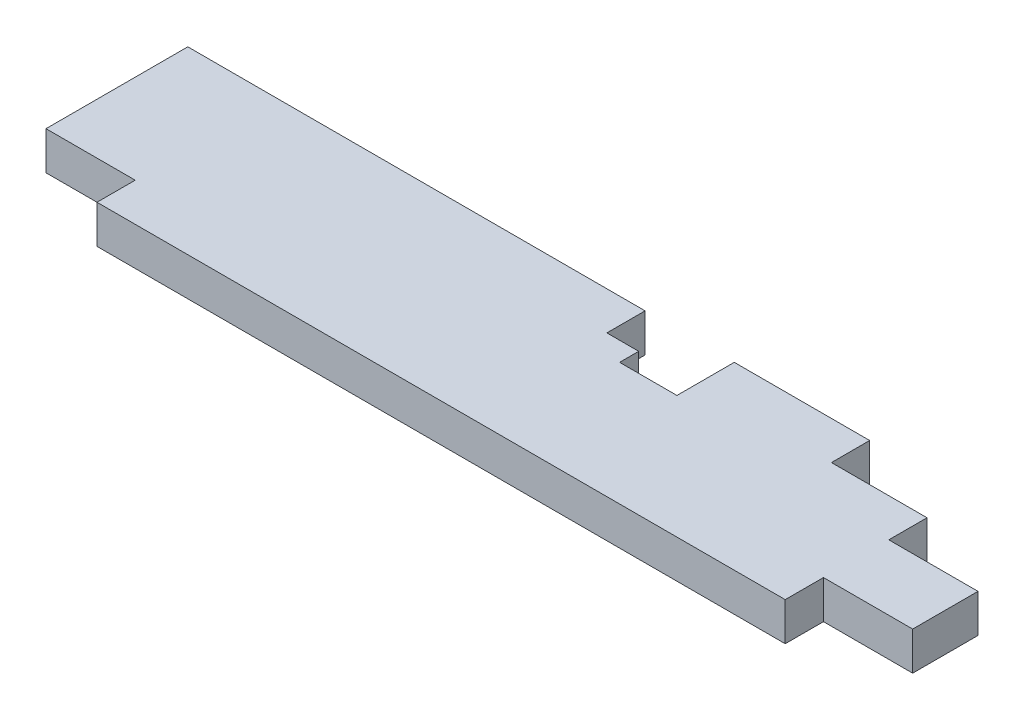
ISO-10303-21;
HEADER;
FILE_DESCRIPTION(('STEP AP214'),'2;1');
FILE_NAME('part.step','',(''),(''),'','','');
FILE_SCHEMA(('AUTOMOTIVE_DESIGN { 1 0 10303 214 1 1 1 1 }'));
ENDSEC;
DATA;
#1=APPLICATION_CONTEXT('core data for automotive mechanical design processes');
#2=APPLICATION_PROTOCOL_DEFINITION('international standard','automotive_design',2000,#1);
#3=PRODUCT_CONTEXT('',#1,'mechanical');
#4=PRODUCT('Part','Part','',(#3));
#5=PRODUCT_RELATED_PRODUCT_CATEGORY('part','',(#4));
#6=PRODUCT_DEFINITION_FORMATION('','',#4);
#7=PRODUCT_DEFINITION_CONTEXT('part definition',#1,'design');
#8=PRODUCT_DEFINITION('design','',#6,#7);
#9=PRODUCT_DEFINITION_SHAPE('','',#8);
#10=(LENGTH_UNIT() NAMED_UNIT(*) SI_UNIT(.MILLI.,.METRE.));
#11=(NAMED_UNIT(*) PLANE_ANGLE_UNIT() SI_UNIT($,.RADIAN.));
#12=(NAMED_UNIT(*) SI_UNIT($,.STERADIAN.) SOLID_ANGLE_UNIT());
#13=UNCERTAINTY_MEASURE_WITH_UNIT(LENGTH_MEASURE(1.E-05),#10,'distance_accuracy_value','');
#14=(GEOMETRIC_REPRESENTATION_CONTEXT(3) GLOBAL_UNCERTAINTY_ASSIGNED_CONTEXT((#13)) GLOBAL_UNIT_ASSIGNED_CONTEXT((#10,
#11,#12)) REPRESENTATION_CONTEXT('',''));
#15=CARTESIAN_POINT('',(0.,0.,0.));
#16=DIRECTION('',(0.,0.,1.));
#17=DIRECTION('',(1.,0.,0.));
#18=AXIS2_PLACEMENT_3D('',#15,#16,#17);
#19=CARTESIAN_POINT('',(0.,38.1,-179.3875));
#20=DIRECTION('',(0.,0.,1.));
#21=DIRECTION('',(1.,0.,0.));
#22=AXIS2_PLACEMENT_3D('',#19,#20,#21);
#23=PLANE('',#22);
#24=DIRECTION('',(0.,-1.,0.));
#25=VECTOR('',#24,1.);
#26=CARTESIAN_POINT('',(544.564540790002,38.1,-179.3875));
#27=LINE('',#26,#25);
#28=CARTESIAN_POINT('',(544.564540790002,38.1,-179.3875));
#29=VERTEX_POINT('',#28);
#30=CARTESIAN_POINT('',(544.564540790002,0.,-179.3875));
#31=VERTEX_POINT('',#30);
#32=EDGE_CURVE('E240',#29,#31,#27,.T.);
#33=ORIENTED_EDGE('',*,*,#32,.F.);
#34=DIRECTION('',(-1.,0.,0.));
#35=VECTOR('',#34,1.);
#36=CARTESIAN_POINT('',(0.,38.1,-179.3875));
#37=LINE('',#36,#35);
#38=CARTESIAN_POINT('',(679.45,38.1,-179.3875));
#39=VERTEX_POINT('',#38);
#40=EDGE_CURVE('E49',#39,#29,#37,.T.);
#41=ORIENTED_EDGE('',*,*,#40,.F.);
#42=DIRECTION('',(0.,-1.,0.));
#43=VECTOR('',#42,1.);
#44=CARTESIAN_POINT('',(679.45,38.1,-179.3875));
#45=LINE('',#44,#43);
#46=CARTESIAN_POINT('',(679.45,0.,-179.3875));
#47=VERTEX_POINT('',#46);
#48=EDGE_CURVE('E260',#39,#47,#45,.T.);
#49=ORIENTED_EDGE('',*,*,#48,.T.);
#50=DIRECTION('',(-1.,0.,0.));
#51=VECTOR('',#50,1.);
#52=CARTESIAN_POINT('',(0.,0.,-179.3875));
#53=LINE('',#52,#51);
#54=EDGE_CURVE('E289',#47,#31,#53,.T.);
#55=ORIENTED_EDGE('',*,*,#54,.T.);
#56=EDGE_LOOP('',(#33,#41,#49,#55));
#57=FACE_BOUND('',#56,.T.);
#58=ADVANCED_FACE('F41',(#57),#23,.F.);
#59=DIRECTION('',(0.,-1.,0.));
#60=VECTOR('',#59,1.);
#61=CARTESIAN_POINT('',(455.676,38.1,-179.3875));
#62=LINE('',#61,#60);
#63=CARTESIAN_POINT('',(455.676,38.1,-179.3875));
#64=VERTEX_POINT('',#63);
#65=CARTESIAN_POINT('',(455.676,0.,-179.3875));
#66=VERTEX_POINT('',#65);
#67=EDGE_CURVE('E242',#64,#66,#62,.T.);
#68=ORIENTED_EDGE('',*,*,#67,.T.);
#69=CARTESIAN_POINT('',(0.,0.,-179.3875));
#70=VERTEX_POINT('',#69);
#71=EDGE_CURVE('E301',#66,#70,#53,.T.);
#72=ORIENTED_EDGE('',*,*,#71,.T.);
#73=DIRECTION('',(0.,-1.,0.));
#74=VECTOR('',#73,1.);
#75=CARTESIAN_POINT('',(0.,38.1,-179.3875));
#76=LINE('',#75,#74);
#77=CARTESIAN_POINT('',(0.,38.1,-179.3875));
#78=VERTEX_POINT('',#77);
#79=EDGE_CURVE('E11',#78,#70,#76,.T.);
#80=ORIENTED_EDGE('',*,*,#79,.F.);
#81=EDGE_CURVE('E294',#64,#78,#37,.T.);
#82=ORIENTED_EDGE('',*,*,#81,.F.);
#83=EDGE_LOOP('',(#68,#72,#80,#82));
#84=FACE_BOUND('',#83,.T.);
#85=ADVANCED_FACE('F309',(#84),#23,.F.);
#86=CARTESIAN_POINT('',(0.,38.1,0.));
#87=DIRECTION('',(0.,-1.,0.));
#88=DIRECTION('',(0.,0.,-1.));
#89=AXIS2_PLACEMENT_3D('',#86,#87,#88);
#90=PLANE('',#89);
#91=DIRECTION('',(0.,0.,1.));
#92=VECTOR('',#91,1.);
#93=CARTESIAN_POINT('',(0.,38.1,0.));
#94=LINE('',#93,#92);
#95=CARTESIAN_POINT('',(0.,38.1,-38.1));
#96=VERTEX_POINT('',#95);
#97=EDGE_CURVE('E285',#78,#96,#94,.T.);
#98=ORIENTED_EDGE('',*,*,#97,.T.);
#99=DIRECTION('',(-1.,0.,0.));
#100=VECTOR('',#99,1.);
#101=CARTESIAN_POINT('',(0.,38.1,-38.1));
#102=LINE('',#101,#100);
#103=CARTESIAN_POINT('',(88.9,38.1,-38.1));
#104=VERTEX_POINT('',#103);
#105=EDGE_CURVE('E186',#104,#96,#102,.T.);
#106=ORIENTED_EDGE('',*,*,#105,.F.);
#107=DIRECTION('',(0.,0.,-1.));
#108=VECTOR('',#107,1.);
#109=CARTESIAN_POINT('',(88.9,38.1,0.));
#110=LINE('',#109,#108);
#111=CARTESIAN_POINT('',(88.9,38.1,0.));
#112=VERTEX_POINT('',#111);
#113=EDGE_CURVE('E168',#112,#104,#110,.T.);
#114=ORIENTED_EDGE('',*,*,#113,.F.);
#115=DIRECTION('',(1.,0.,0.));
#116=VECTOR('',#115,1.);
#117=CARTESIAN_POINT('',(0.,38.1,0.));
#118=LINE('',#117,#116);
#119=CARTESIAN_POINT('',(774.7,38.1,0.));
#120=VERTEX_POINT('',#119);
#121=EDGE_CURVE('E288',#112,#120,#118,.T.);
#122=ORIENTED_EDGE('',*,*,#121,.T.);
#123=DIRECTION('',(0.,0.,-1.));
#124=VECTOR('',#123,1.);
#125=CARTESIAN_POINT('',(774.7,38.1,0.));
#126=LINE('',#125,#124);
#127=CARTESIAN_POINT('',(774.7,38.1,-38.1));
#128=VERTEX_POINT('',#127);
#129=EDGE_CURVE('E266',#120,#128,#126,.T.);
#130=ORIENTED_EDGE('',*,*,#129,.T.);
#131=DIRECTION('',(1.,0.,0.));
#132=VECTOR('',#131,1.);
#133=CARTESIAN_POINT('',(863.6,38.1,-38.1));
#134=LINE('',#133,#132);
#135=CARTESIAN_POINT('',(863.6,38.1,-38.1));
#136=VERTEX_POINT('',#135);
#137=EDGE_CURVE('E269',#128,#136,#134,.T.);
#138=ORIENTED_EDGE('',*,*,#137,.T.);
#139=DIRECTION('',(0.,0.,-1.));
#140=VECTOR('',#139,1.);
#141=CARTESIAN_POINT('',(863.6,38.1,0.));
#142=LINE('',#141,#140);
#143=CARTESIAN_POINT('',(863.6,38.1,-103.1875));
#144=VERTEX_POINT('',#143);
#145=EDGE_CURVE('E291',#136,#144,#142,.T.);
#146=ORIENTED_EDGE('',*,*,#145,.T.);
#147=DIRECTION('',(-1.,0.,0.));
#148=VECTOR('',#147,1.);
#149=CARTESIAN_POINT('',(863.6,38.1,-103.1875));
#150=LINE('',#149,#148);
#151=CARTESIAN_POINT('',(774.7,38.1,-103.1875));
#152=VERTEX_POINT('',#151);
#153=EDGE_CURVE('E194',#144,#152,#150,.T.);
#154=ORIENTED_EDGE('',*,*,#153,.T.);
#155=DIRECTION('',(0.,0.,-1.));
#156=VECTOR('',#155,1.);
#157=CARTESIAN_POINT('',(774.7,38.1,-141.2875));
#158=LINE('',#157,#156);
#159=CARTESIAN_POINT('',(774.7,38.1,-141.2875));
#160=VERTEX_POINT('',#159);
#161=EDGE_CURVE('E197',#152,#160,#158,.T.);
#162=ORIENTED_EDGE('',*,*,#161,.T.);
#163=DIRECTION('',(-1.,0.,0.));
#164=VECTOR('',#163,1.);
#165=CARTESIAN_POINT('',(863.6,38.1,-141.287500000001));
#166=LINE('',#165,#164);
#167=CARTESIAN_POINT('',(679.45,38.1,-141.2875));
#168=VERTEX_POINT('',#167);
#169=EDGE_CURVE('E251',#160,#168,#166,.T.);
#170=ORIENTED_EDGE('',*,*,#169,.T.);
#171=DIRECTION('',(0.,0.,-1.));
#172=VECTOR('',#171,1.);
#173=CARTESIAN_POINT('',(679.45,38.1,-179.3875));
#174=LINE('',#173,#172);
#175=EDGE_CURVE('E253',#168,#39,#174,.T.);
#176=ORIENTED_EDGE('',*,*,#175,.T.);
#177=ORIENTED_EDGE('',*,*,#40,.T.);
#178=DIRECTION('',(0.,0.,-1.));
#179=VECTOR('',#178,1.);
#180=CARTESIAN_POINT('',(544.564540790002,38.1,0.));
#181=LINE('',#180,#179);
#182=CARTESIAN_POINT('',(544.564540790002,38.1,-122.237499999995));
#183=VERTEX_POINT('',#182);
#184=EDGE_CURVE('E222',#183,#29,#181,.T.);
#185=ORIENTED_EDGE('',*,*,#184,.F.);
#186=DIRECTION('',(-1.,0.,0.));
#187=VECTOR('',#186,1.);
#188=CARTESIAN_POINT('',(0.,38.1,-122.237499999995));
#189=LINE('',#188,#187);
#190=CARTESIAN_POINT('',(487.426,38.1,-122.237499999995));
#191=VERTEX_POINT('',#190);
#192=EDGE_CURVE('E210',#183,#191,#189,.T.);
#193=ORIENTED_EDGE('',*,*,#192,.T.);
#194=DIRECTION('',(0.,0.,-1.));
#195=VECTOR('',#194,1.);
#196=CARTESIAN_POINT('',(487.426,38.1,0.));
#197=LINE('',#196,#195);
#198=CARTESIAN_POINT('',(487.426,38.1,-141.287499999995));
#199=VERTEX_POINT('',#198);
#200=EDGE_CURVE('E213',#191,#199,#197,.T.);
#201=ORIENTED_EDGE('',*,*,#200,.T.);
#202=DIRECTION('',(-1.,0.,0.));
#203=VECTOR('',#202,1.);
#204=CARTESIAN_POINT('',(0.,38.1,-141.287499999995));
#205=LINE('',#204,#203);
#206=CARTESIAN_POINT('',(455.676,38.1,-141.287499999995));
#207=VERTEX_POINT('',#206);
#208=EDGE_CURVE('E217',#199,#207,#205,.T.);
#209=ORIENTED_EDGE('',*,*,#208,.T.);
#210=DIRECTION('',(0.,0.,1.));
#211=VECTOR('',#210,1.);
#212=CARTESIAN_POINT('',(455.676,38.1,0.));
#213=LINE('',#212,#211);
#214=EDGE_CURVE('E220',#64,#207,#213,.T.);
#215=ORIENTED_EDGE('',*,*,#214,.F.);
#216=ORIENTED_EDGE('',*,*,#81,.T.);
#217=EDGE_LOOP('',(#98,#106,#114,#122,#130,#138,#146,#154,#162,#170,#176,#177,#185,#193,#201,
#209,#215,#216));
#218=FACE_BOUND('',#217,.T.);
#219=ADVANCED_FACE('F314',(#218),#90,.F.);
#220=CARTESIAN_POINT('',(0.,0.,0.));
#221=DIRECTION('',(0.,-1.,0.));
#222=DIRECTION('',(0.,0.,-1.));
#223=AXIS2_PLACEMENT_3D('',#220,#221,#222);
#224=PLANE('',#223);
#225=DIRECTION('',(-1.,0.,0.));
#226=VECTOR('',#225,1.);
#227=CARTESIAN_POINT('',(0.,0.,-38.1));
#228=LINE('',#227,#226);
#229=CARTESIAN_POINT('',(88.9,0.,-38.1));
#230=VERTEX_POINT('',#229);
#231=CARTESIAN_POINT('',(0.,0.,-38.1));
#232=VERTEX_POINT('',#231);
#233=EDGE_CURVE('E175',#230,#232,#228,.T.);
#234=ORIENTED_EDGE('',*,*,#233,.T.);
#235=DIRECTION('',(0.,0.,1.));
#236=VECTOR('',#235,1.);
#237=CARTESIAN_POINT('',(0.,0.,0.));
#238=LINE('',#237,#236);
#239=EDGE_CURVE('E280',#70,#232,#238,.T.);
#240=ORIENTED_EDGE('',*,*,#239,.F.);
#241=ORIENTED_EDGE('',*,*,#71,.F.);
#242=DIRECTION('',(0.,0.,1.));
#243=VECTOR('',#242,1.);
#244=CARTESIAN_POINT('',(455.676,0.,0.));
#245=LINE('',#244,#243);
#246=CARTESIAN_POINT('',(455.676,0.,-141.287499999995));
#247=VERTEX_POINT('',#246);
#248=EDGE_CURVE('E232',#66,#247,#245,.T.);
#249=ORIENTED_EDGE('',*,*,#248,.T.);
#250=DIRECTION('',(-1.,0.,0.));
#251=VECTOR('',#250,1.);
#252=CARTESIAN_POINT('',(0.,0.,-141.287499999995));
#253=LINE('',#252,#251);
#254=CARTESIAN_POINT('',(487.426,0.,-141.287499999995));
#255=VERTEX_POINT('',#254);
#256=EDGE_CURVE('E229',#255,#247,#253,.T.);
#257=ORIENTED_EDGE('',*,*,#256,.F.);
#258=DIRECTION('',(0.,0.,-1.));
#259=VECTOR('',#258,1.);
#260=CARTESIAN_POINT('',(487.426,0.,0.));
#261=LINE('',#260,#259);
#262=CARTESIAN_POINT('',(487.426,0.,-122.237499999995));
#263=VERTEX_POINT('',#262);
#264=EDGE_CURVE('E226',#263,#255,#261,.T.);
#265=ORIENTED_EDGE('',*,*,#264,.F.);
#266=DIRECTION('',(-1.,0.,0.));
#267=VECTOR('',#266,1.);
#268=CARTESIAN_POINT('',(0.,0.,-122.237499999995));
#269=LINE('',#268,#267);
#270=CARTESIAN_POINT('',(544.564540790002,0.,-122.237499999995));
#271=VERTEX_POINT('',#270);
#272=EDGE_CURVE('E206',#271,#263,#269,.T.);
#273=ORIENTED_EDGE('',*,*,#272,.F.);
#274=DIRECTION('',(0.,0.,-1.));
#275=VECTOR('',#274,1.);
#276=CARTESIAN_POINT('',(544.564540790002,0.,0.));
#277=LINE('',#276,#275);
#278=EDGE_CURVE('E214',#271,#31,#277,.T.);
#279=ORIENTED_EDGE('',*,*,#278,.T.);
#280=ORIENTED_EDGE('',*,*,#54,.F.);
#281=DIRECTION('',(0.,0.,-1.));
#282=VECTOR('',#281,1.);
#283=CARTESIAN_POINT('',(679.45,0.,-179.3875));
#284=LINE('',#283,#282);
#285=CARTESIAN_POINT('',(679.45,0.,-141.2875));
#286=VERTEX_POINT('',#285);
#287=EDGE_CURVE('E254',#286,#47,#284,.T.);
#288=ORIENTED_EDGE('',*,*,#287,.F.);
#289=DIRECTION('',(-1.,0.,0.));
#290=VECTOR('',#289,1.);
#291=CARTESIAN_POINT('',(863.6,0.,-141.287500000001));
#292=LINE('',#291,#290);
#293=CARTESIAN_POINT('',(774.7,0.,-141.287500000001));
#294=VERTEX_POINT('',#293);
#295=EDGE_CURVE('E239',#294,#286,#292,.T.);
#296=ORIENTED_EDGE('',*,*,#295,.F.);
#297=DIRECTION('',(0.,0.,-1.));
#298=VECTOR('',#297,1.);
#299=CARTESIAN_POINT('',(774.7,0.,-141.2875));
#300=LINE('',#299,#298);
#301=CARTESIAN_POINT('',(774.7,0.,-103.1875));
#302=VERTEX_POINT('',#301);
#303=EDGE_CURVE('E64',#302,#294,#300,.T.);
#304=ORIENTED_EDGE('',*,*,#303,.F.);
#305=DIRECTION('',(-1.,0.,0.));
#306=VECTOR('',#305,1.);
#307=CARTESIAN_POINT('',(863.6,0.,-103.1875));
#308=LINE('',#307,#306);
#309=CARTESIAN_POINT('',(863.6,0.,-103.1875));
#310=VERTEX_POINT('',#309);
#311=EDGE_CURVE('E191',#310,#302,#308,.T.);
#312=ORIENTED_EDGE('',*,*,#311,.F.);
#313=DIRECTION('',(0.,0.,-1.));
#314=VECTOR('',#313,1.);
#315=CARTESIAN_POINT('',(863.6,0.,0.));
#316=LINE('',#315,#314);
#317=CARTESIAN_POINT('',(863.6,0.,-38.1));
#318=VERTEX_POINT('',#317);
#319=EDGE_CURVE('E299',#318,#310,#316,.T.);
#320=ORIENTED_EDGE('',*,*,#319,.F.);
#321=DIRECTION('',(1.,0.,0.));
#322=VECTOR('',#321,1.);
#323=CARTESIAN_POINT('',(863.6,0.,-38.1));
#324=LINE('',#323,#322);
#325=CARTESIAN_POINT('',(774.7,0.,-38.1));
#326=VERTEX_POINT('',#325);
#327=EDGE_CURVE('E270',#326,#318,#324,.T.);
#328=ORIENTED_EDGE('',*,*,#327,.F.);
#329=DIRECTION('',(0.,0.,-1.));
#330=VECTOR('',#329,1.);
#331=CARTESIAN_POINT('',(774.7,0.,0.));
#332=LINE('',#331,#330);
#333=CARTESIAN_POINT('',(774.7,0.,0.));
#334=VERTEX_POINT('',#333);
#335=EDGE_CURVE('E263',#334,#326,#332,.T.);
#336=ORIENTED_EDGE('',*,*,#335,.F.);
#337=DIRECTION('',(1.,0.,0.));
#338=VECTOR('',#337,1.);
#339=CARTESIAN_POINT('',(0.,0.,0.));
#340=LINE('',#339,#338);
#341=CARTESIAN_POINT('',(88.9,0.,0.));
#342=VERTEX_POINT('',#341);
#343=EDGE_CURVE('E185',#342,#334,#340,.T.);
#344=ORIENTED_EDGE('',*,*,#343,.F.);
#345=DIRECTION('',(0.,0.,-1.));
#346=VECTOR('',#345,1.);
#347=CARTESIAN_POINT('',(88.9,0.,0.));
#348=LINE('',#347,#346);
#349=EDGE_CURVE('E56',#342,#230,#348,.T.);
#350=ORIENTED_EDGE('',*,*,#349,.T.);
#351=EDGE_LOOP('',(#234,#240,#241,#249,#257,#265,#273,#279,#280,#288,#296,#304,#312,#320,#328,
#336,#344,#350));
#352=FACE_BOUND('',#351,.T.);
#353=ADVANCED_FACE('F183',(#352),#224,.T.);
#354=CARTESIAN_POINT('',(0.,38.1,0.));
#355=DIRECTION('',(1.,0.,0.));
#356=DIRECTION('',(0.,0.,-1.));
#357=AXIS2_PLACEMENT_3D('',#354,#355,#356);
#358=PLANE('',#357);
#359=ORIENTED_EDGE('',*,*,#239,.T.);
#360=DIRECTION('',(0.,1.,0.));
#361=VECTOR('',#360,1.);
#362=CARTESIAN_POINT('',(0.,0.,-38.1));
#363=LINE('',#362,#361);
#364=EDGE_CURVE('E171',#232,#96,#363,.T.);
#365=ORIENTED_EDGE('',*,*,#364,.T.);
#366=ORIENTED_EDGE('',*,*,#97,.F.);
#367=ORIENTED_EDGE('',*,*,#79,.T.);
#368=EDGE_LOOP('',(#359,#365,#366,#367));
#369=FACE_BOUND('',#368,.T.);
#370=ADVANCED_FACE('F43',(#369),#358,.F.);
#371=CARTESIAN_POINT('',(0.,38.1,0.));
#372=DIRECTION('',(0.,0.,-1.));
#373=DIRECTION('',(-1.,0.,0.));
#374=AXIS2_PLACEMENT_3D('',#371,#372,#373);
#375=PLANE('',#374);
#376=ORIENTED_EDGE('',*,*,#121,.F.);
#377=DIRECTION('',(0.,1.,0.));
#378=VECTOR('',#377,1.);
#379=CARTESIAN_POINT('',(88.9,0.,0.));
#380=LINE('',#379,#378);
#381=EDGE_CURVE('E172',#342,#112,#380,.T.);
#382=ORIENTED_EDGE('',*,*,#381,.F.);
#383=ORIENTED_EDGE('',*,*,#343,.T.);
#384=DIRECTION('',(0.,-1.,0.));
#385=VECTOR('',#384,1.);
#386=CARTESIAN_POINT('',(774.7,38.1,0.));
#387=LINE('',#386,#385);
#388=EDGE_CURVE('E273',#120,#334,#387,.T.);
#389=ORIENTED_EDGE('',*,*,#388,.F.);
#390=EDGE_LOOP('',(#376,#382,#383,#389));
#391=FACE_BOUND('',#390,.T.);
#392=ADVANCED_FACE('F365',(#391),#375,.F.);
#393=CARTESIAN_POINT('',(863.6,38.1,0.));
#394=DIRECTION('',(-1.,0.,0.));
#395=DIRECTION('',(0.,0.,1.));
#396=AXIS2_PLACEMENT_3D('',#393,#394,#395);
#397=PLANE('',#396);
#398=ORIENTED_EDGE('',*,*,#319,.T.);
#399=DIRECTION('',(0.,-1.,0.));
#400=VECTOR('',#399,1.);
#401=CARTESIAN_POINT('',(863.6,38.1,-103.1875));
#402=LINE('',#401,#400);
#403=EDGE_CURVE('E200',#144,#310,#402,.T.);
#404=ORIENTED_EDGE('',*,*,#403,.F.);
#405=ORIENTED_EDGE('',*,*,#145,.F.);
#406=DIRECTION('',(0.,-1.,0.));
#407=VECTOR('',#406,1.);
#408=CARTESIAN_POINT('',(863.6,38.1,-38.1));
#409=LINE('',#408,#407);
#410=EDGE_CURVE('E277',#136,#318,#409,.T.);
#411=ORIENTED_EDGE('',*,*,#410,.T.);
#412=EDGE_LOOP('',(#398,#404,#405,#411));
#413=FACE_BOUND('',#412,.T.);
#414=ADVANCED_FACE('F353',(#413),#397,.F.);
#415=CARTESIAN_POINT('',(863.6,38.1,-38.1));
#416=DIRECTION('',(0.,0.,-1.));
#417=DIRECTION('',(-1.,0.,0.));
#418=AXIS2_PLACEMENT_3D('',#415,#416,#417);
#419=PLANE('',#418);
#420=ORIENTED_EDGE('',*,*,#327,.T.);
#421=ORIENTED_EDGE('',*,*,#410,.F.);
#422=ORIENTED_EDGE('',*,*,#137,.F.);
#423=DIRECTION('',(0.,-1.,0.));
#424=VECTOR('',#423,1.);
#425=CARTESIAN_POINT('',(774.7,38.1,-38.1));
#426=LINE('',#425,#424);
#427=EDGE_CURVE('E281',#128,#326,#426,.T.);
#428=ORIENTED_EDGE('',*,*,#427,.T.);
#429=EDGE_LOOP('',(#420,#421,#422,#428));
#430=FACE_BOUND('',#429,.T.);
#431=ADVANCED_FACE('F357',(#430),#419,.F.);
#432=CARTESIAN_POINT('',(774.7,38.1,0.));
#433=DIRECTION('',(-1.,0.,0.));
#434=DIRECTION('',(0.,0.,1.));
#435=AXIS2_PLACEMENT_3D('',#432,#433,#434);
#436=PLANE('',#435);
#437=ORIENTED_EDGE('',*,*,#335,.T.);
#438=ORIENTED_EDGE('',*,*,#427,.F.);
#439=ORIENTED_EDGE('',*,*,#129,.F.);
#440=ORIENTED_EDGE('',*,*,#388,.T.);
#441=EDGE_LOOP('',(#437,#438,#439,#440));
#442=FACE_BOUND('',#441,.T.);
#443=ADVANCED_FACE('F361',(#442),#436,.F.);
#444=CARTESIAN_POINT('',(679.45,38.1,-179.3875));
#445=DIRECTION('',(-1.,0.,0.));
#446=DIRECTION('',(0.,0.,1.));
#447=AXIS2_PLACEMENT_3D('',#444,#445,#446);
#448=PLANE('',#447);
#449=ORIENTED_EDGE('',*,*,#287,.T.);
#450=ORIENTED_EDGE('',*,*,#48,.F.);
#451=ORIENTED_EDGE('',*,*,#175,.F.);
#452=DIRECTION('',(0.,-1.,0.));
#453=VECTOR('',#452,1.);
#454=CARTESIAN_POINT('',(679.45,38.1,-141.2875));
#455=LINE('',#454,#453);
#456=EDGE_CURVE('E257',#168,#286,#455,.T.);
#457=ORIENTED_EDGE('',*,*,#456,.T.);
#458=EDGE_LOOP('',(#449,#450,#451,#457));
#459=FACE_BOUND('',#458,.T.);
#460=ADVANCED_FACE('F338',(#459),#448,.F.);
#461=CARTESIAN_POINT('',(863.6,38.1,-141.287500000001));
#462=DIRECTION('',(0.,0.,1.));
#463=DIRECTION('',(1.,0.,0.));
#464=AXIS2_PLACEMENT_3D('',#461,#462,#463);
#465=PLANE('',#464);
#466=ORIENTED_EDGE('',*,*,#169,.F.);
#467=DIRECTION('',(0.,-1.,0.));
#468=VECTOR('',#467,1.);
#469=CARTESIAN_POINT('',(774.7,38.1,-141.2875));
#470=LINE('',#469,#468);
#471=EDGE_CURVE('E204',#160,#294,#470,.T.);
#472=ORIENTED_EDGE('',*,*,#471,.T.);
#473=ORIENTED_EDGE('',*,*,#295,.T.);
#474=ORIENTED_EDGE('',*,*,#456,.F.);
#475=EDGE_LOOP('',(#466,#472,#473,#474));
#476=FACE_BOUND('',#475,.T.);
#477=ADVANCED_FACE('F345',(#476),#465,.F.);
#478=CARTESIAN_POINT('',(0.,38.1,-122.237499999995));
#479=DIRECTION('',(0.,0.,1.));
#480=DIRECTION('',(1.,0.,0.));
#481=AXIS2_PLACEMENT_3D('',#478,#479,#480);
#482=PLANE('',#481);
#483=ORIENTED_EDGE('',*,*,#272,.T.);
#484=DIRECTION('',(0.,-1.,0.));
#485=VECTOR('',#484,1.);
#486=CARTESIAN_POINT('',(487.426,38.1,-122.237499999995));
#487=LINE('',#486,#485);
#488=EDGE_CURVE('E224',#191,#263,#487,.T.);
#489=ORIENTED_EDGE('',*,*,#488,.F.);
#490=ORIENTED_EDGE('',*,*,#192,.F.);
#491=DIRECTION('',(0.,-1.,0.));
#492=VECTOR('',#491,1.);
#493=CARTESIAN_POINT('',(544.564540790002,38.1,-122.237499999995));
#494=LINE('',#493,#492);
#495=EDGE_CURVE('E237',#183,#271,#494,.T.);
#496=ORIENTED_EDGE('',*,*,#495,.T.);
#497=EDGE_LOOP('',(#483,#489,#490,#496));
#498=FACE_BOUND('',#497,.T.);
#499=ADVANCED_FACE('F330',(#498),#482,.F.);
#500=CARTESIAN_POINT('',(544.564540790002,38.1,0.));
#501=DIRECTION('',(-1.,0.,0.));
#502=DIRECTION('',(0.,0.,1.));
#503=AXIS2_PLACEMENT_3D('',#500,#501,#502);
#504=PLANE('',#503);
#505=ORIENTED_EDGE('',*,*,#278,.F.);
#506=ORIENTED_EDGE('',*,*,#495,.F.);
#507=ORIENTED_EDGE('',*,*,#184,.T.);
#508=ORIENTED_EDGE('',*,*,#32,.T.);
#509=EDGE_LOOP('',(#505,#506,#507,#508));
#510=FACE_BOUND('',#509,.T.);
#511=ADVANCED_FACE('F334',(#510),#504,.T.);
#512=CARTESIAN_POINT('',(455.676,38.1,0.));
#513=DIRECTION('',(1.,0.,0.));
#514=DIRECTION('',(0.,0.,-1.));
#515=AXIS2_PLACEMENT_3D('',#512,#513,#514);
#516=PLANE('',#515);
#517=ORIENTED_EDGE('',*,*,#248,.F.);
#518=ORIENTED_EDGE('',*,*,#67,.F.);
#519=ORIENTED_EDGE('',*,*,#214,.T.);
#520=DIRECTION('',(0.,-1.,0.));
#521=VECTOR('',#520,1.);
#522=CARTESIAN_POINT('',(455.676,38.1,-141.287499999995));
#523=LINE('',#522,#521);
#524=EDGE_CURVE('E245',#207,#247,#523,.T.);
#525=ORIENTED_EDGE('',*,*,#524,.T.);
#526=EDGE_LOOP('',(#517,#518,#519,#525));
#527=FACE_BOUND('',#526,.T.);
#528=ADVANCED_FACE('F319',(#527),#516,.T.);
#529=CARTESIAN_POINT('',(0.,38.1,-141.287499999995));
#530=DIRECTION('',(0.,0.,1.));
#531=DIRECTION('',(1.,0.,0.));
#532=AXIS2_PLACEMENT_3D('',#529,#530,#531);
#533=PLANE('',#532);
#534=ORIENTED_EDGE('',*,*,#256,.T.);
#535=ORIENTED_EDGE('',*,*,#524,.F.);
#536=ORIENTED_EDGE('',*,*,#208,.F.);
#537=DIRECTION('',(0.,-1.,0.));
#538=VECTOR('',#537,1.);
#539=CARTESIAN_POINT('',(487.426,38.1,-141.287499999995));
#540=LINE('',#539,#538);
#541=EDGE_CURVE('E247',#199,#255,#540,.T.);
#542=ORIENTED_EDGE('',*,*,#541,.T.);
#543=EDGE_LOOP('',(#534,#535,#536,#542));
#544=FACE_BOUND('',#543,.T.);
#545=ADVANCED_FACE('F321',(#544),#533,.F.);
#546=CARTESIAN_POINT('',(487.426,38.1,0.));
#547=DIRECTION('',(-1.,0.,0.));
#548=DIRECTION('',(0.,0.,1.));
#549=AXIS2_PLACEMENT_3D('',#546,#547,#548);
#550=PLANE('',#549);
#551=ORIENTED_EDGE('',*,*,#264,.T.);
#552=ORIENTED_EDGE('',*,*,#541,.F.);
#553=ORIENTED_EDGE('',*,*,#200,.F.);
#554=ORIENTED_EDGE('',*,*,#488,.T.);
#555=EDGE_LOOP('',(#551,#552,#553,#554));
#556=FACE_BOUND('',#555,.T.);
#557=ADVANCED_FACE('F326',(#556),#550,.F.);
#558=CARTESIAN_POINT('',(774.7,38.1,-141.2875));
#559=DIRECTION('',(-1.,0.,0.));
#560=DIRECTION('',(0.,0.,1.));
#561=AXIS2_PLACEMENT_3D('',#558,#559,#560);
#562=PLANE('',#561);
#563=ORIENTED_EDGE('',*,*,#303,.T.);
#564=ORIENTED_EDGE('',*,*,#471,.F.);
#565=ORIENTED_EDGE('',*,*,#161,.F.);
#566=DIRECTION('',(0.,-1.,0.));
#567=VECTOR('',#566,1.);
#568=CARTESIAN_POINT('',(774.7,38.1,-103.1875));
#569=LINE('',#568,#567);
#570=EDGE_CURVE('E207',#152,#302,#569,.T.);
#571=ORIENTED_EDGE('',*,*,#570,.T.);
#572=EDGE_LOOP('',(#563,#564,#565,#571));
#573=FACE_BOUND('',#572,.T.);
#574=ADVANCED_FACE('F346',(#573),#562,.F.);
#575=CARTESIAN_POINT('',(863.6,38.1,-103.1875));
#576=DIRECTION('',(0.,0.,1.));
#577=DIRECTION('',(1.,0.,0.));
#578=AXIS2_PLACEMENT_3D('',#575,#576,#577);
#579=PLANE('',#578);
#580=ORIENTED_EDGE('',*,*,#311,.T.);
#581=ORIENTED_EDGE('',*,*,#570,.F.);
#582=ORIENTED_EDGE('',*,*,#153,.F.);
#583=ORIENTED_EDGE('',*,*,#403,.T.);
#584=EDGE_LOOP('',(#580,#581,#582,#583));
#585=FACE_BOUND('',#584,.T.);
#586=ADVANCED_FACE('F350',(#585),#579,.F.);
#587=CARTESIAN_POINT('',(0.,0.,-38.1));
#588=DIRECTION('',(0.,0.,-1.));
#589=DIRECTION('',(-1.,0.,0.));
#590=AXIS2_PLACEMENT_3D('',#587,#588,#589);
#591=PLANE('',#590);
#592=ORIENTED_EDGE('',*,*,#105,.T.);
#593=ORIENTED_EDGE('',*,*,#364,.F.);
#594=ORIENTED_EDGE('',*,*,#233,.F.);
#595=DIRECTION('',(0.,1.,0.));
#596=VECTOR('',#595,1.);
#597=CARTESIAN_POINT('',(88.9,0.,-38.1));
#598=LINE('',#597,#596);
#599=EDGE_CURVE('E164',#230,#104,#598,.T.);
#600=ORIENTED_EDGE('',*,*,#599,.T.);
#601=EDGE_LOOP('',(#592,#593,#594,#600));
#602=FACE_BOUND('',#601,.T.);
#603=ADVANCED_FACE('F176',(#602),#591,.F.);
#604=CARTESIAN_POINT('',(88.9,0.,0.));
#605=DIRECTION('',(1.,0.,0.));
#606=DIRECTION('',(0.,0.,-1.));
#607=AXIS2_PLACEMENT_3D('',#604,#605,#606);
#608=PLANE('',#607);
#609=ORIENTED_EDGE('',*,*,#113,.T.);
#610=ORIENTED_EDGE('',*,*,#599,.F.);
#611=ORIENTED_EDGE('',*,*,#349,.F.);
#612=ORIENTED_EDGE('',*,*,#381,.T.);
#613=EDGE_LOOP('',(#609,#610,#611,#612));
#614=FACE_BOUND('',#613,.T.);
#615=ADVANCED_FACE('F166',(#614),#608,.F.);
#616=CLOSED_SHELL('',(#58,#85,#219,#353,#370,#392,#414,#431,#443,#460,#477,#499,#511,#528,#545,
#557,#574,#586,#603,#615));
#617=MANIFOLD_SOLID_BREP('B2',#616);
#618=ADVANCED_BREP_SHAPE_REPRESENTATION('',(#18,#617),#14);
#619=SHAPE_DEFINITION_REPRESENTATION(#9,#618);
ENDSEC;
END-ISO-10303-21;
